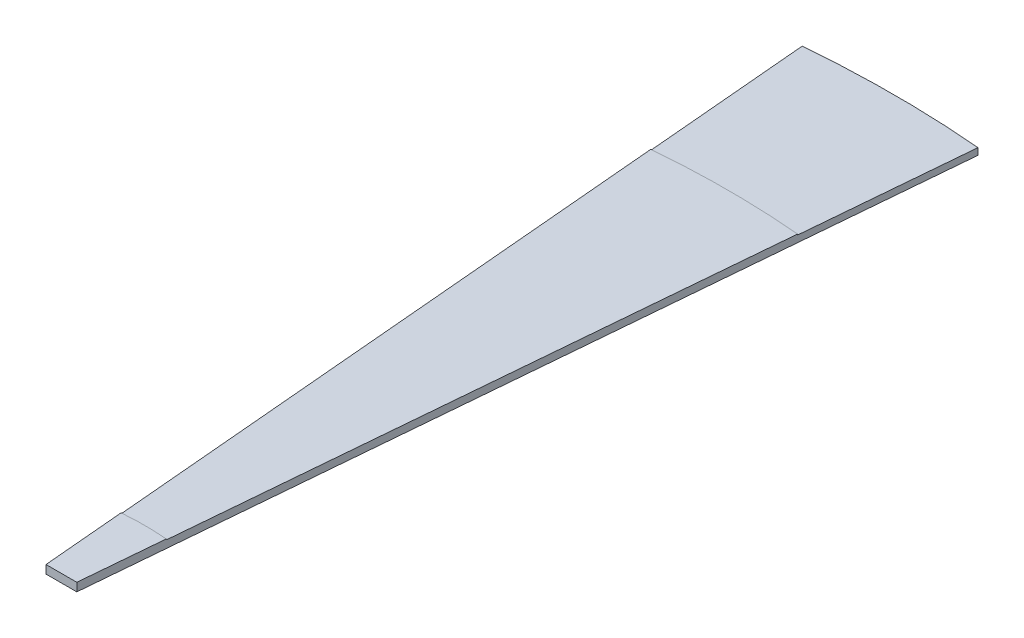
ISO-10303-21;
HEADER;
FILE_DESCRIPTION(('STEP AP214'),'2;1');
FILE_NAME('part.step','',(''),(''),'','','');
FILE_SCHEMA(('AUTOMOTIVE_DESIGN { 1 0 10303 214 1 1 1 1 }'));
ENDSEC;
DATA;
#1=APPLICATION_CONTEXT('core data for automotive mechanical design processes');
#2=APPLICATION_PROTOCOL_DEFINITION('international standard','automotive_design',2000,#1);
#3=PRODUCT_CONTEXT('',#1,'mechanical');
#4=PRODUCT('Part','Part','',(#3));
#5=PRODUCT_RELATED_PRODUCT_CATEGORY('part','',(#4));
#6=PRODUCT_DEFINITION_FORMATION('','',#4);
#7=PRODUCT_DEFINITION_CONTEXT('part definition',#1,'design');
#8=PRODUCT_DEFINITION('design','',#6,#7);
#9=PRODUCT_DEFINITION_SHAPE('','',#8);
#10=(LENGTH_UNIT() NAMED_UNIT(*) SI_UNIT(.MILLI.,.METRE.));
#11=(NAMED_UNIT(*) PLANE_ANGLE_UNIT() SI_UNIT($,.RADIAN.));
#12=(NAMED_UNIT(*) SI_UNIT($,.STERADIAN.) SOLID_ANGLE_UNIT());
#13=UNCERTAINTY_MEASURE_WITH_UNIT(LENGTH_MEASURE(1.E-05),#10,'distance_accuracy_value','');
#14=(GEOMETRIC_REPRESENTATION_CONTEXT(3) GLOBAL_UNCERTAINTY_ASSIGNED_CONTEXT((#13)) GLOBAL_UNIT_ASSIGNED_CONTEXT((#10,
#11,#12)) REPRESENTATION_CONTEXT('',''));
#15=CARTESIAN_POINT('',(0.,0.,0.));
#16=DIRECTION('',(0.,0.,1.));
#17=DIRECTION('',(1.,0.,0.));
#18=AXIS2_PLACEMENT_3D('',#15,#16,#17);
#19=CARTESIAN_POINT('',(0.,9.,211.455967601084));
#20=DIRECTION('',(0.,-1.,0.));
#21=DIRECTION('',(0.,0.,-1.));
#22=AXIS2_PLACEMENT_3D('',#19,#20,#21);
#23=CYLINDRICAL_SURFACE('',#22,1011.45596760108);
#24=DIRECTION('',(0.,-1.,0.));
#25=VECTOR('',#24,1.);
#26=CARTESIAN_POINT('',(88.1541961128246,9.,-796.151104676372));
#27=LINE('',#26,#25);
#28=CARTESIAN_POINT('',(88.1541961128246,9.,-796.151104676372));
#29=VERTEX_POINT('',#28);
#30=CARTESIAN_POINT('',(88.1541961128246,8.,-796.151104676372));
#31=VERTEX_POINT('',#30);
#32=EDGE_CURVE('E110',#29,#31,#27,.T.);
#33=ORIENTED_EDGE('',*,*,#32,.T.);
#34=CARTESIAN_POINT('',(0.,8.,211.455967601084));
#35=DIRECTION('',(0.,1.,0.));
#36=DIRECTION('',(0.,0.,-1.));
#37=AXIS2_PLACEMENT_3D('',#34,#35,#36);
#38=CIRCLE('',#37,1011.45596760108);
#39=CARTESIAN_POINT('',(-88.1541961128243,8.,-796.151104676372));
#40=VERTEX_POINT('',#39);
#41=EDGE_CURVE('E97',#31,#40,#38,.T.);
#42=ORIENTED_EDGE('',*,*,#41,.T.);
#43=DIRECTION('',(0.,-1.,0.));
#44=VECTOR('',#43,1.);
#45=CARTESIAN_POINT('',(-88.1541961128243,9.,-796.151104676372));
#46=LINE('',#45,#44);
#47=CARTESIAN_POINT('',(-88.1541961128243,9.,-796.151104676372));
#48=VERTEX_POINT('',#47);
#49=EDGE_CURVE('E108',#48,#40,#46,.T.);
#50=ORIENTED_EDGE('',*,*,#49,.F.);
#51=CARTESIAN_POINT('',(0.,9.,211.455967601084));
#52=DIRECTION('',(0.,-1.,0.));
#53=DIRECTION('',(0.,0.,-1.));
#54=AXIS2_PLACEMENT_3D('',#51,#52,#53);
#55=CIRCLE('',#54,1011.45596760108);
#56=EDGE_CURVE('E122',#48,#29,#55,.T.);
#57=ORIENTED_EDGE('',*,*,#56,.T.);
#58=EDGE_LOOP('',(#33,#42,#50,#57));
#59=FACE_BOUND('',#58,.T.);
#60=ADVANCED_FACE('F31',(#59),#23,.T.);
#61=CARTESIAN_POINT('',(0.,10.,211.455967601084));
#62=DIRECTION('',(0.,-1.,0.));
#63=DIRECTION('',(0.,0.,-1.));
#64=AXIS2_PLACEMENT_3D('',#61,#62,#63);
#65=CYLINDRICAL_SURFACE('',#64,311.455967601084);
#66=CARTESIAN_POINT('',(0.,9.,211.455967601084));
#67=DIRECTION('',(0.,1.,0.));
#68=DIRECTION('',(0.,0.,-1.));
#69=AXIS2_PLACEMENT_3D('',#66,#67,#68);
#70=CIRCLE('',#69,311.455967601084);
#71=CARTESIAN_POINT('',(27.1451761894632,9.,-98.8148160121503));
#72=VERTEX_POINT('',#71);
#73=CARTESIAN_POINT('',(-27.1451761894632,9.,-98.8148160121503));
#74=VERTEX_POINT('',#73);
#75=EDGE_CURVE('E48',#72,#74,#70,.T.);
#76=ORIENTED_EDGE('',*,*,#75,.T.);
#77=DIRECTION('',(0.,-1.,0.));
#78=VECTOR('',#77,1.);
#79=CARTESIAN_POINT('',(-27.1451761894632,10.,-98.8148160121503));
#80=LINE('',#79,#78);
#81=CARTESIAN_POINT('',(-27.1451761894632,10.,-98.8148160121503));
#82=VERTEX_POINT('',#81);
#83=EDGE_CURVE('E39',#82,#74,#80,.T.);
#84=ORIENTED_EDGE('',*,*,#83,.F.);
#85=CARTESIAN_POINT('',(0.,10.,211.455967601084));
#86=DIRECTION('',(0.,1.,0.));
#87=DIRECTION('',(0.,0.,-1.));
#88=AXIS2_PLACEMENT_3D('',#85,#86,#87);
#89=CIRCLE('',#88,311.455967601084);
#90=CARTESIAN_POINT('',(27.1451761894632,10.,-98.8148160121503));
#91=VERTEX_POINT('',#90);
#92=EDGE_CURVE('E128',#91,#82,#89,.T.);
#93=ORIENTED_EDGE('',*,*,#92,.F.);
#94=DIRECTION('',(0.,-1.,0.));
#95=VECTOR('',#94,1.);
#96=CARTESIAN_POINT('',(27.1451761894632,10.,-98.8148160121503));
#97=LINE('',#96,#95);
#98=EDGE_CURVE('E11',#91,#72,#97,.T.);
#99=ORIENTED_EDGE('',*,*,#98,.T.);
#100=EDGE_LOOP('',(#76,#84,#93,#99));
#101=FACE_BOUND('',#100,.T.);
#102=ADVANCED_FACE('F177',(#101),#65,.T.);
#103=CARTESIAN_POINT('',(18.5,10.,0.));
#104=DIRECTION('',(-0.996194698091746,0.,-0.0871557427476588));
#105=DIRECTION('',(-0.0871557427476588,0.,0.996194698091746));
#106=AXIS2_PLACEMENT_3D('',#103,#104,#105);
#107=PLANE('',#106);
#108=DIRECTION('',(0.0871557427476588,0.,-0.996194698091745));
#109=VECTOR('',#108,1.);
#110=CARTESIAN_POINT('',(18.5,0.,0.));
#111=LINE('',#110,#109);
#112=CARTESIAN_POINT('',(18.5,0.,0.));
#113=VERTEX_POINT('',#112);
#114=CARTESIAN_POINT('',(105.585344662356,0.,-995.390044294722));
#115=VERTEX_POINT('',#114);
#116=EDGE_CURVE('E119',#113,#115,#111,.T.);
#117=ORIENTED_EDGE('',*,*,#116,.T.);
#118=DIRECTION('',(0.,-1.,0.));
#119=VECTOR('',#118,1.);
#120=CARTESIAN_POINT('',(105.585344662356,8.,-995.390044294722));
#121=LINE('',#120,#119);
#122=CARTESIAN_POINT('',(105.585344662356,8.,-995.390044294722));
#123=VERTEX_POINT('',#122);
#124=EDGE_CURVE('E151',#123,#115,#121,.T.);
#125=ORIENTED_EDGE('',*,*,#124,.F.);
#126=DIRECTION('',(-0.0871557427476572,0.,0.996194698091746));
#127=VECTOR('',#126,1.);
#128=CARTESIAN_POINT('',(88.1541961128246,8.,-796.151104676372));
#129=LINE('',#128,#127);
#130=EDGE_CURVE('E156',#123,#31,#129,.T.);
#131=ORIENTED_EDGE('',*,*,#130,.T.);
#132=ORIENTED_EDGE('',*,*,#32,.F.);
#133=DIRECTION('',(-0.0871557427476596,0.,0.996194698091745));
#134=VECTOR('',#133,1.);
#135=CARTESIAN_POINT('',(27.1451761894632,9.,-98.8148160121503));
#136=LINE('',#135,#134);
#137=EDGE_CURVE('E117',#29,#72,#136,.T.);
#138=ORIENTED_EDGE('',*,*,#137,.T.);
#139=ORIENTED_EDGE('',*,*,#98,.F.);
#140=DIRECTION('',(0.0871557427476588,0.,-0.996194698091745));
#141=VECTOR('',#140,1.);
#142=CARTESIAN_POINT('',(18.5,10.,0.));
#143=LINE('',#142,#141);
#144=CARTESIAN_POINT('',(18.5,10.,0.));
#145=VERTEX_POINT('',#144);
#146=EDGE_CURVE('E125',#145,#91,#143,.T.);
#147=ORIENTED_EDGE('',*,*,#146,.F.);
#148=DIRECTION('',(0.,-1.,0.));
#149=VECTOR('',#148,1.);
#150=CARTESIAN_POINT('',(18.5,10.,0.));
#151=LINE('',#150,#149);
#152=EDGE_CURVE('E135',#145,#113,#151,.T.);
#153=ORIENTED_EDGE('',*,*,#152,.T.);
#154=EDGE_LOOP('',(#117,#125,#131,#132,#138,#139,#147,#153));
#155=FACE_BOUND('',#154,.T.);
#156=ADVANCED_FACE('F33',(#155),#107,.F.);
#157=CARTESIAN_POINT('',(-18.5,10.,0.));
#158=DIRECTION('',(0.996194698091746,0.,-0.0871557427476588));
#159=DIRECTION('',(-0.0871557427476588,0.,-0.996194698091746));
#160=AXIS2_PLACEMENT_3D('',#157,#158,#159);
#161=PLANE('',#160);
#162=DIRECTION('',(0.0871557427476588,0.,0.996194698091745));
#163=VECTOR('',#162,1.);
#164=CARTESIAN_POINT('',(-18.5,0.,0.));
#165=LINE('',#164,#163);
#166=CARTESIAN_POINT('',(-105.585344662356,0.,-995.390044294721));
#167=VERTEX_POINT('',#166);
#168=CARTESIAN_POINT('',(-18.5,0.,0.));
#169=VERTEX_POINT('',#168);
#170=EDGE_CURVE('E137',#167,#169,#165,.T.);
#171=ORIENTED_EDGE('',*,*,#170,.T.);
#172=DIRECTION('',(0.,-1.,0.));
#173=VECTOR('',#172,1.);
#174=CARTESIAN_POINT('',(-18.5,10.,0.));
#175=LINE('',#174,#173);
#176=CARTESIAN_POINT('',(-18.5,10.,0.));
#177=VERTEX_POINT('',#176);
#178=EDGE_CURVE('E142',#177,#169,#175,.T.);
#179=ORIENTED_EDGE('',*,*,#178,.F.);
#180=DIRECTION('',(0.0871557427476588,0.,0.996194698091745));
#181=VECTOR('',#180,1.);
#182=CARTESIAN_POINT('',(-18.5,10.,0.));
#183=LINE('',#182,#181);
#184=EDGE_CURVE('E131',#82,#177,#183,.T.);
#185=ORIENTED_EDGE('',*,*,#184,.F.);
#186=ORIENTED_EDGE('',*,*,#83,.T.);
#187=DIRECTION('',(-0.0871557427476588,0.,-0.996194698091745));
#188=VECTOR('',#187,1.);
#189=CARTESIAN_POINT('',(-27.1451761894632,9.,-98.8148160121503));
#190=LINE('',#189,#188);
#191=EDGE_CURVE('E116',#74,#48,#190,.T.);
#192=ORIENTED_EDGE('',*,*,#191,.T.);
#193=ORIENTED_EDGE('',*,*,#49,.T.);
#194=DIRECTION('',(-0.0871557427476586,0.,-0.996194698091746));
#195=VECTOR('',#194,1.);
#196=CARTESIAN_POINT('',(-88.1541961128243,8.,-796.151104676372));
#197=LINE('',#196,#195);
#198=CARTESIAN_POINT('',(-105.585344662356,8.,-995.390044294721));
#199=VERTEX_POINT('',#198);
#200=EDGE_CURVE('E93',#40,#199,#197,.T.);
#201=ORIENTED_EDGE('',*,*,#200,.T.);
#202=DIRECTION('',(0.,-1.,0.));
#203=VECTOR('',#202,1.);
#204=CARTESIAN_POINT('',(-105.585344662356,8.,-995.390044294721));
#205=LINE('',#204,#203);
#206=EDGE_CURVE('E154',#199,#167,#205,.T.);
#207=ORIENTED_EDGE('',*,*,#206,.T.);
#208=EDGE_LOOP('',(#171,#179,#185,#186,#192,#193,#201,#207));
#209=FACE_BOUND('',#208,.T.);
#210=ADVANCED_FACE('F114',(#209),#161,.F.);
#211=CARTESIAN_POINT('',(18.5,10.,0.));
#212=DIRECTION('',(0.,0.,-1.));
#213=DIRECTION('',(-1.,0.,0.));
#214=AXIS2_PLACEMENT_3D('',#211,#212,#213);
#215=PLANE('',#214);
#216=DIRECTION('',(1.,0.,0.));
#217=VECTOR('',#216,1.);
#218=CARTESIAN_POINT('',(18.5,0.,0.));
#219=LINE('',#218,#217);
#220=EDGE_CURVE('E129',#169,#113,#219,.T.);
#221=ORIENTED_EDGE('',*,*,#220,.T.);
#222=ORIENTED_EDGE('',*,*,#152,.F.);
#223=DIRECTION('',(1.,0.,0.));
#224=VECTOR('',#223,1.);
#225=CARTESIAN_POINT('',(18.5,10.,0.));
#226=LINE('',#225,#224);
#227=EDGE_CURVE('E133',#177,#145,#226,.T.);
#228=ORIENTED_EDGE('',*,*,#227,.F.);
#229=ORIENTED_EDGE('',*,*,#178,.T.);
#230=EDGE_LOOP('',(#221,#222,#228,#229));
#231=FACE_BOUND('',#230,.T.);
#232=ADVANCED_FACE('F174',(#231),#215,.F.);
#233=CARTESIAN_POINT('',(0.,10.,211.455967601084));
#234=DIRECTION('',(0.,-1.,0.));
#235=DIRECTION('',(0.,0.,-1.));
#236=AXIS2_PLACEMENT_3D('',#233,#234,#235);
#237=PLANE('',#236);
#238=ORIENTED_EDGE('',*,*,#146,.T.);
#239=ORIENTED_EDGE('',*,*,#92,.T.);
#240=ORIENTED_EDGE('',*,*,#184,.T.);
#241=ORIENTED_EDGE('',*,*,#227,.T.);
#242=EDGE_LOOP('',(#238,#239,#240,#241));
#243=FACE_BOUND('',#242,.T.);
#244=ADVANCED_FACE('F176',(#243),#237,.F.);
#245=CARTESIAN_POINT('',(0.,0.,211.455967601084));
#246=DIRECTION('',(0.,-1.,0.));
#247=DIRECTION('',(0.,0.,-1.));
#248=AXIS2_PLACEMENT_3D('',#245,#246,#247);
#249=PLANE('',#248);
#250=ORIENTED_EDGE('',*,*,#116,.F.);
#251=ORIENTED_EDGE('',*,*,#220,.F.);
#252=ORIENTED_EDGE('',*,*,#170,.F.);
#253=CARTESIAN_POINT('',(0.,0.,211.455967601084));
#254=DIRECTION('',(0.,-1.,0.));
#255=DIRECTION('',(0.,0.,-1.));
#256=AXIS2_PLACEMENT_3D('',#253,#254,#255);
#257=CIRCLE('',#256,1211.45596760108);
#258=EDGE_CURVE('E111',#167,#115,#257,.T.);
#259=ORIENTED_EDGE('',*,*,#258,.T.);
#260=EDGE_LOOP('',(#250,#251,#252,#259));
#261=FACE_BOUND('',#260,.T.);
#262=ADVANCED_FACE('F171',(#261),#249,.T.);
#263=CARTESIAN_POINT('',(0.,9.,211.455967601084));
#264=DIRECTION('',(0.,-1.,0.));
#265=DIRECTION('',(0.,0.,-1.));
#266=AXIS2_PLACEMENT_3D('',#263,#264,#265);
#267=PLANE('',#266);
#268=ORIENTED_EDGE('',*,*,#75,.F.);
#269=ORIENTED_EDGE('',*,*,#137,.F.);
#270=ORIENTED_EDGE('',*,*,#56,.F.);
#271=ORIENTED_EDGE('',*,*,#191,.F.);
#272=EDGE_LOOP('',(#268,#269,#270,#271));
#273=FACE_BOUND('',#272,.T.);
#274=ADVANCED_FACE('F147',(#273),#267,.F.);
#275=CARTESIAN_POINT('',(0.,8.,211.455967601084));
#276=DIRECTION('',(0.,-1.,0.));
#277=DIRECTION('',(0.,0.,-1.));
#278=AXIS2_PLACEMENT_3D('',#275,#276,#277);
#279=CYLINDRICAL_SURFACE('',#278,1211.45596760108);
#280=ORIENTED_EDGE('',*,*,#258,.F.);
#281=ORIENTED_EDGE('',*,*,#206,.F.);
#282=CARTESIAN_POINT('',(0.,8.,211.455967601084));
#283=DIRECTION('',(0.,-1.,0.));
#284=DIRECTION('',(0.,0.,-1.));
#285=AXIS2_PLACEMENT_3D('',#282,#283,#284);
#286=CIRCLE('',#285,1211.45596760108);
#287=EDGE_CURVE('E100',#199,#123,#286,.T.);
#288=ORIENTED_EDGE('',*,*,#287,.T.);
#289=ORIENTED_EDGE('',*,*,#124,.T.);
#290=EDGE_LOOP('',(#280,#281,#288,#289));
#291=FACE_BOUND('',#290,.T.);
#292=ADVANCED_FACE('F164',(#291),#279,.T.);
#293=CARTESIAN_POINT('',(0.,8.,211.455967601084));
#294=DIRECTION('',(0.,-1.,0.));
#295=DIRECTION('',(0.,0.,-1.));
#296=AXIS2_PLACEMENT_3D('',#293,#294,#295);
#297=PLANE('',#296);
#298=ORIENTED_EDGE('',*,*,#41,.F.);
#299=ORIENTED_EDGE('',*,*,#130,.F.);
#300=ORIENTED_EDGE('',*,*,#287,.F.);
#301=ORIENTED_EDGE('',*,*,#200,.F.);
#302=EDGE_LOOP('',(#298,#299,#300,#301));
#303=FACE_BOUND('',#302,.T.);
#304=ADVANCED_FACE('F95',(#303),#297,.F.);
#305=CLOSED_SHELL('',(#60,#102,#156,#210,#232,#244,#262,#274,#292,#304));
#306=MANIFOLD_SOLID_BREP('B2',#305);
#307=ADVANCED_BREP_SHAPE_REPRESENTATION('',(#18,#306),#14);
#308=SHAPE_DEFINITION_REPRESENTATION(#9,#307);
ENDSEC;
END-ISO-10303-21;
